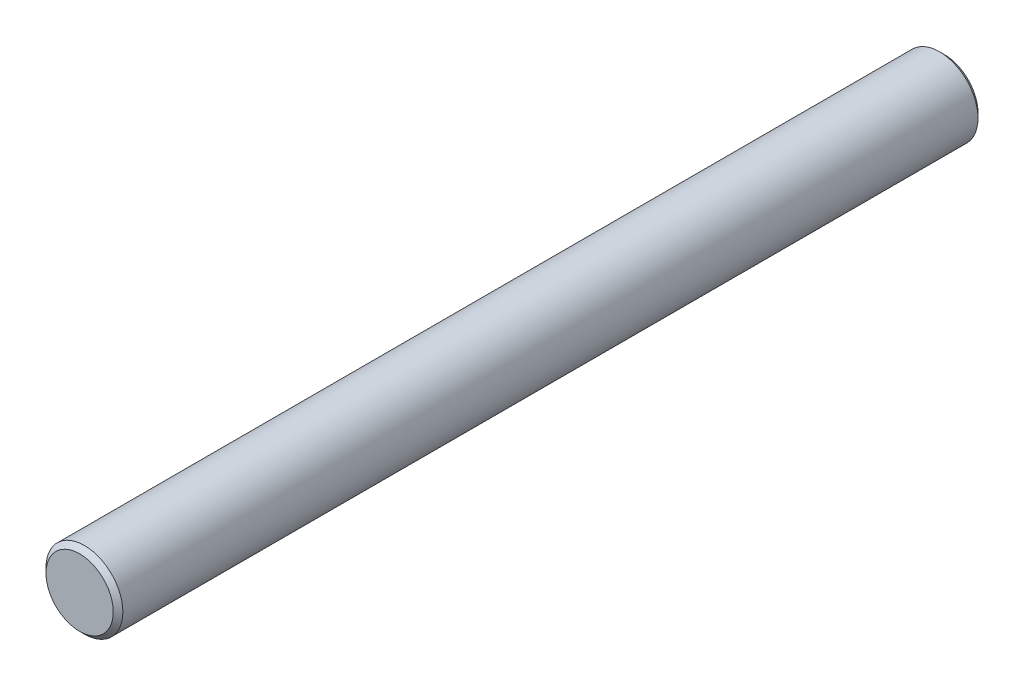
ISO-10303-21;
HEADER;
FILE_DESCRIPTION(('STEP AP214'),'2;1');
FILE_NAME('part.step','',(''),(''),'','','');
FILE_SCHEMA(('AUTOMOTIVE_DESIGN { 1 0 10303 214 1 1 1 1 }'));
ENDSEC;
DATA;
#1=APPLICATION_CONTEXT('core data for automotive mechanical design processes');
#2=APPLICATION_PROTOCOL_DEFINITION('international standard','automotive_design',2000,#1);
#3=PRODUCT_CONTEXT('',#1,'mechanical');
#4=PRODUCT('Part','Part','',(#3));
#5=PRODUCT_RELATED_PRODUCT_CATEGORY('part','',(#4));
#6=PRODUCT_DEFINITION_FORMATION('','',#4);
#7=PRODUCT_DEFINITION_CONTEXT('part definition',#1,'design');
#8=PRODUCT_DEFINITION('design','',#6,#7);
#9=PRODUCT_DEFINITION_SHAPE('','',#8);
#10=(LENGTH_UNIT() NAMED_UNIT(*) SI_UNIT(.MILLI.,.METRE.));
#11=(NAMED_UNIT(*) PLANE_ANGLE_UNIT() SI_UNIT($,.RADIAN.));
#12=(NAMED_UNIT(*) SI_UNIT($,.STERADIAN.) SOLID_ANGLE_UNIT());
#13=UNCERTAINTY_MEASURE_WITH_UNIT(LENGTH_MEASURE(1.E-05),#10,'distance_accuracy_value','');
#14=(GEOMETRIC_REPRESENTATION_CONTEXT(3) GLOBAL_UNCERTAINTY_ASSIGNED_CONTEXT((#13)) GLOBAL_UNIT_ASSIGNED_CONTEXT((#10,
#11,#12)) REPRESENTATION_CONTEXT('',''));
#15=CARTESIAN_POINT('',(0.,0.,0.));
#16=DIRECTION('',(0.,0.,1.));
#17=DIRECTION('',(1.,0.,0.));
#18=AXIS2_PLACEMENT_3D('',#15,#16,#17);
#19=CARTESIAN_POINT('',(0.,0.,90.));
#20=DIRECTION('',(0.,0.,1.));
#21=DIRECTION('',(1.,0.,0.));
#22=AXIS2_PLACEMENT_3D('',#19,#20,#21);
#23=PLANE('',#22);
#24=CARTESIAN_POINT('',(0.,0.,89.9999999999181));
#25=DIRECTION('',(0.,0.,-1.));
#26=DIRECTION('',(-1.,0.,0.));
#27=AXIS2_PLACEMENT_3D('',#24,#25,#26);
#28=CIRCLE('',#27,3.49999999997408);
#29=CARTESIAN_POINT('',(-3.49999999997408,0.,89.9999999999181));
#30=VERTEX_POINT('',#29);
#31=EDGE_CURVE('E17',#30,#30,#28,.T.);
#32=ORIENTED_EDGE('',*,*,#31,.F.);
#33=EDGE_LOOP('',(#32));
#34=FACE_BOUND('',#33,.T.);
#35=ADVANCED_FACE('F14',(#34),#23,.T.);
#36=CARTESIAN_POINT('',(0.,0.,0.));
#37=DIRECTION('',(0.,0.,1.));
#38=DIRECTION('',(1.,0.,0.));
#39=AXIS2_PLACEMENT_3D('',#36,#37,#38);
#40=PLANE('',#39);
#41=CARTESIAN_POINT('',(0.,0.,0.));
#42=DIRECTION('',(0.,0.,1.));
#43=DIRECTION('',(1.,0.,0.));
#44=AXIS2_PLACEMENT_3D('',#41,#42,#43);
#45=CIRCLE('',#44,3.49999999997408);
#46=CARTESIAN_POINT('',(3.49999999997408,0.,0.));
#47=VERTEX_POINT('',#46);
#48=EDGE_CURVE('E26',#47,#47,#45,.T.);
#49=ORIENTED_EDGE('',*,*,#48,.F.);
#50=EDGE_LOOP('',(#49));
#51=FACE_BOUND('',#50,.T.);
#52=ADVANCED_FACE('F37',(#51),#40,.F.);
#53=CARTESIAN_POINT('',(0.,0.,89.5000000000437));
#54=DIRECTION('',(0.,0.,-1.));
#55=DIRECTION('',(-1.,0.,0.));
#56=AXIS2_PLACEMENT_3D('',#53,#54,#55);
#57=CONICAL_SURFACE('',#56,3.99999999990541,0.785398163454292);
#58=CARTESIAN_POINT('',(0.,0.,89.5));
#59=DIRECTION('',(0.,0.,1.));
#60=DIRECTION('',(1.,0.,0.));
#61=AXIS2_PLACEMENT_3D('',#58,#59,#60);
#62=CIRCLE('',#61,4.);
#63=CARTESIAN_POINT('',(4.,0.,89.5));
#64=VERTEX_POINT('',#63);
#65=EDGE_CURVE('E21',#64,#64,#62,.F.);
#66=ORIENTED_EDGE('',*,*,#65,.F.);
#67=EDGE_LOOP('',(#66));
#68=FACE_BOUND('',#67,.T.);
#69=ORIENTED_EDGE('',*,*,#31,.T.);
#70=EDGE_LOOP('',(#69));
#71=FACE_BOUND('',#70,.T.);
#72=ADVANCED_FACE('F34',(#68,#71),#57,.T.);
#73=CARTESIAN_POINT('',(0.,0.,0.499999999931333));
#74=DIRECTION('',(0.,0.,1.));
#75=DIRECTION('',(1.,0.,0.));
#76=AXIS2_PLACEMENT_3D('',#73,#74,#75);
#77=CONICAL_SURFACE('',#76,3.99999999990541,0.785398163397448);
#78=ORIENTED_EDGE('',*,*,#48,.T.);
#79=EDGE_LOOP('',(#78));
#80=FACE_BOUND('',#79,.T.);
#81=CARTESIAN_POINT('',(0.,0.,0.5));
#82=DIRECTION('',(0.,0.,1.));
#83=DIRECTION('',(1.,0.,0.));
#84=AXIS2_PLACEMENT_3D('',#81,#82,#83);
#85=CIRCLE('',#84,4.);
#86=CARTESIAN_POINT('',(4.,0.,0.5));
#87=VERTEX_POINT('',#86);
#88=EDGE_CURVE('E10',#87,#87,#85,.T.);
#89=ORIENTED_EDGE('',*,*,#88,.F.);
#90=EDGE_LOOP('',(#89));
#91=FACE_BOUND('',#90,.T.);
#92=ADVANCED_FACE('F45',(#80,#91),#77,.T.);
#93=CARTESIAN_POINT('',(0.,0.,0.));
#94=DIRECTION('',(0.,0.,1.));
#95=DIRECTION('',(1.,0.,0.));
#96=AXIS2_PLACEMENT_3D('',#93,#94,#95);
#97=CYLINDRICAL_SURFACE('',#96,4.);
#98=ORIENTED_EDGE('',*,*,#88,.T.);
#99=EDGE_LOOP('',(#98));
#100=FACE_BOUND('',#99,.T.);
#101=ORIENTED_EDGE('',*,*,#65,.T.);
#102=EDGE_LOOP('',(#101));
#103=FACE_BOUND('',#102,.T.);
#104=ADVANCED_FACE('F43',(#100,#103),#97,.T.);
#105=CLOSED_SHELL('',(#35,#52,#72,#92,#104));
#106=MANIFOLD_SOLID_BREP('B1',#105);
#107=ADVANCED_BREP_SHAPE_REPRESENTATION('',(#18,#106),#14);
#108=SHAPE_DEFINITION_REPRESENTATION(#9,#107);
ENDSEC;
END-ISO-10303-21;
